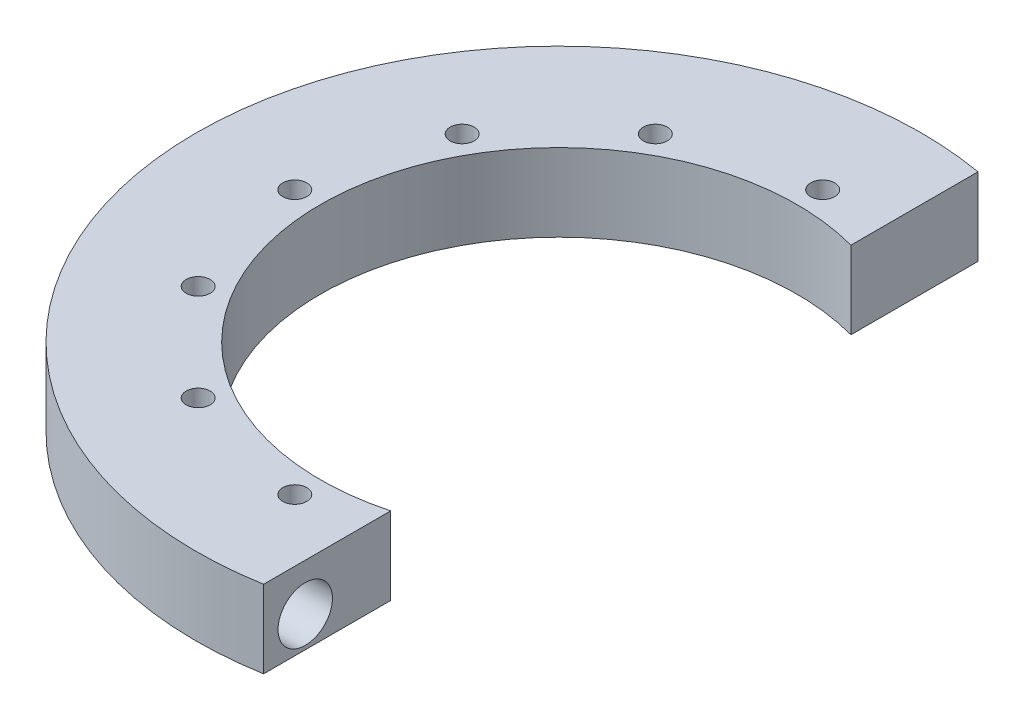
ISO-10303-21;
HEADER;
FILE_DESCRIPTION(('STEP AP214'),'2;1');
FILE_NAME('part.step','',(''),(''),'','','');
FILE_SCHEMA(('AUTOMOTIVE_DESIGN { 1 0 10303 214 1 1 1 1 }'));
ENDSEC;
DATA;
#1=APPLICATION_CONTEXT('core data for automotive mechanical design processes');
#2=APPLICATION_PROTOCOL_DEFINITION('international standard','automotive_design',2000,#1);
#3=PRODUCT_CONTEXT('',#1,'mechanical');
#4=PRODUCT('Part','Part','',(#3));
#5=PRODUCT_RELATED_PRODUCT_CATEGORY('part','',(#4));
#6=PRODUCT_DEFINITION_FORMATION('','',#4);
#7=PRODUCT_DEFINITION_CONTEXT('part definition',#1,'design');
#8=PRODUCT_DEFINITION('design','',#6,#7);
#9=PRODUCT_DEFINITION_SHAPE('','',#8);
#10=(LENGTH_UNIT() NAMED_UNIT(*) SI_UNIT(.MILLI.,.METRE.));
#11=(NAMED_UNIT(*) PLANE_ANGLE_UNIT() SI_UNIT($,.RADIAN.));
#12=(NAMED_UNIT(*) SI_UNIT($,.STERADIAN.) SOLID_ANGLE_UNIT());
#13=UNCERTAINTY_MEASURE_WITH_UNIT(LENGTH_MEASURE(1.E-05),#10,'distance_accuracy_value','');
#14=(GEOMETRIC_REPRESENTATION_CONTEXT(3) GLOBAL_UNCERTAINTY_ASSIGNED_CONTEXT((#13)) GLOBAL_UNIT_ASSIGNED_CONTEXT((#10,
#11,#12)) REPRESENTATION_CONTEXT('',''));
#15=CARTESIAN_POINT('',(0.,0.,0.));
#16=DIRECTION('',(0.,0.,1.));
#17=DIRECTION('',(1.,0.,0.));
#18=AXIS2_PLACEMENT_3D('',#15,#16,#17);
#19=CARTESIAN_POINT('',(0.,-12.7,0.));
#20=DIRECTION('',(1.,0.,0.));
#21=DIRECTION('',(0.,0.,-1.));
#22=AXIS2_PLACEMENT_3D('',#19,#20,#21);
#23=PLANE('',#22);
#24=DIRECTION('',(0.,1.,0.));
#25=VECTOR('',#24,1.);
#26=CARTESIAN_POINT('',(0.,-12.7,61.3579689022021));
#27=LINE('',#26,#25);
#28=CARTESIAN_POINT('',(0.,-1.78519592415086,61.3579689022021));
#29=VERTEX_POINT('',#28);
#30=CARTESIAN_POINT('',(0.,0.,61.3579689022021));
#31=VERTEX_POINT('',#30);
#32=EDGE_CURVE('E155',#29,#31,#27,.T.);
#33=ORIENTED_EDGE('',*,*,#32,.F.);
#34=CARTESIAN_POINT('',(0.,-6.35,64.536818145106));
#35=DIRECTION('',(1.,0.,0.));
#36=DIRECTION('',(0.,0.,-1.));
#37=AXIS2_PLACEMENT_3D('',#34,#35,#36);
#38=CIRCLE('',#37,5.56259999999999);
#39=CARTESIAN_POINT('',(0.,-1.78519592415087,67.71566738801));
#40=VERTEX_POINT('',#39);
#41=EDGE_CURVE('E144',#29,#40,#38,.T.);
#42=ORIENTED_EDGE('',*,*,#41,.T.);
#43=DIRECTION('',(0.,1.,0.));
#44=VECTOR('',#43,1.);
#45=CARTESIAN_POINT('',(0.,-12.7,67.71566738801));
#46=LINE('',#45,#44);
#47=CARTESIAN_POINT('',(0.,0.,67.71566738801));
#48=VERTEX_POINT('',#47);
#49=EDGE_CURVE('E153',#40,#48,#46,.T.);
#50=ORIENTED_EDGE('',*,*,#49,.T.);
#51=DIRECTION('',(0.,0.,-1.));
#52=VECTOR('',#51,1.);
#53=CARTESIAN_POINT('',(0.,0.,0.));
#54=LINE('',#53,#52);
#55=EDGE_CURVE('E230',#48,#31,#54,.T.);
#56=ORIENTED_EDGE('',*,*,#55,.T.);
#57=EDGE_LOOP('',(#33,#42,#50,#56));
#58=FACE_BOUND('',#57,.T.);
#59=ADVANCED_FACE('F39',(#58),#23,.F.);
#60=CARTESIAN_POINT('',(12.7,3.175,0.));
#61=DIRECTION('',(1.,0.,0.));
#62=DIRECTION('',(0.,0.,-1.));
#63=AXIS2_PLACEMENT_3D('',#60,#61,#62);
#64=PLANE('',#63);
#65=CARTESIAN_POINT('',(12.7,-6.35,64.536818145106));
#66=DIRECTION('',(1.,0.,0.));
#67=DIRECTION('',(0.,0.,-1.));
#68=AXIS2_PLACEMENT_3D('',#65,#66,#67);
#69=CIRCLE('',#68,5.56259999999999);
#70=CARTESIAN_POINT('',(12.7,-6.35,58.9742181451061));
#71=VERTEX_POINT('',#70);
#72=EDGE_CURVE('E326',#71,#71,#69,.T.);
#73=ORIENTED_EDGE('',*,*,#72,.F.);
#74=EDGE_LOOP('',(#73));
#75=FACE_BOUND('',#74,.T.);
#76=DIRECTION('',(0.,-1.,0.));
#77=VECTOR('',#76,1.);
#78=CARTESIAN_POINT('',(12.7,3.175,73.0442228845211));
#79=LINE('',#78,#77);
#80=CARTESIAN_POINT('',(12.7,3.175,73.0442228845211));
#81=VERTEX_POINT('',#80);
#82=CARTESIAN_POINT('',(12.7,-12.7,73.0442228845211));
#83=VERTEX_POINT('',#82);
#84=EDGE_CURVE('E189',#81,#83,#79,.T.);
#85=ORIENTED_EDGE('',*,*,#84,.T.);
#86=DIRECTION('',(0.,0.,1.));
#87=VECTOR('',#86,1.);
#88=CARTESIAN_POINT('',(12.7,-12.7,0.));
#89=LINE('',#88,#87);
#90=CARTESIAN_POINT('',(12.7,-12.7,47.0563858451071));
#91=VERTEX_POINT('',#90);
#92=EDGE_CURVE('E205',#91,#83,#89,.T.);
#93=ORIENTED_EDGE('',*,*,#92,.F.);
#94=DIRECTION('',(0.,-1.,0.));
#95=VECTOR('',#94,1.);
#96=CARTESIAN_POINT('',(12.7,3.175,47.0563858451071));
#97=LINE('',#96,#95);
#98=CARTESIAN_POINT('',(12.7,3.175,47.0563858451071));
#99=VERTEX_POINT('',#98);
#100=EDGE_CURVE('E53',#99,#91,#97,.T.);
#101=ORIENTED_EDGE('',*,*,#100,.F.);
#102=DIRECTION('',(0.,0.,1.));
#103=VECTOR('',#102,1.);
#104=CARTESIAN_POINT('',(12.7,3.175,0.));
#105=LINE('',#104,#103);
#106=EDGE_CURVE('E178',#99,#81,#105,.T.);
#107=ORIENTED_EDGE('',*,*,#106,.T.);
#108=EDGE_LOOP('',(#85,#93,#101,#107));
#109=FACE_BOUND('',#108,.T.);
#110=ADVANCED_FACE('F41',(#75,#109),#64,.T.);
#111=CARTESIAN_POINT('',(0.,3.175,0.));
#112=DIRECTION('',(0.,-1.,0.));
#113=DIRECTION('',(0.,0.,-1.));
#114=AXIS2_PLACEMENT_3D('',#111,#112,#113);
#115=CYLINDRICAL_SURFACE('',#114,48.74006);
#116=ORIENTED_EDGE('',*,*,#100,.T.);
#117=CARTESIAN_POINT('',(0.,-12.7,0.));
#118=DIRECTION('',(0.,1.,0.));
#119=DIRECTION('',(0.,0.,1.));
#120=AXIS2_PLACEMENT_3D('',#117,#118,#119);
#121=CIRCLE('',#120,48.74006);
#122=CARTESIAN_POINT('',(12.7,-12.7,-47.0563858451071));
#123=VERTEX_POINT('',#122);
#124=EDGE_CURVE('E201',#91,#123,#121,.F.);
#125=ORIENTED_EDGE('',*,*,#124,.T.);
#126=DIRECTION('',(0.,-1.,0.));
#127=VECTOR('',#126,1.);
#128=CARTESIAN_POINT('',(12.7,3.175,-47.0563858451071));
#129=LINE('',#128,#127);
#130=CARTESIAN_POINT('',(12.7,3.175,-47.0563858451071));
#131=VERTEX_POINT('',#130);
#132=EDGE_CURVE('E193',#131,#123,#129,.T.);
#133=ORIENTED_EDGE('',*,*,#132,.F.);
#134=CARTESIAN_POINT('',(0.,3.175,0.));
#135=DIRECTION('',(0.,1.,0.));
#136=DIRECTION('',(0.,0.,1.));
#137=AXIS2_PLACEMENT_3D('',#134,#135,#136);
#138=CIRCLE('',#137,48.74006);
#139=EDGE_CURVE('E181',#99,#131,#138,.F.);
#140=ORIENTED_EDGE('',*,*,#139,.F.);
#141=EDGE_LOOP('',(#116,#125,#133,#140));
#142=FACE_BOUND('',#141,.T.);
#143=ADVANCED_FACE('F198',(#142),#115,.F.);
#144=CARTESIAN_POINT('',(12.7,3.175,0.));
#145=DIRECTION('',(1.,0.,0.));
#146=DIRECTION('',(0.,0.,-1.));
#147=AXIS2_PLACEMENT_3D('',#144,#145,#146);
#148=PLANE('',#147);
#149=ORIENTED_EDGE('',*,*,#132,.T.);
#150=DIRECTION('',(0.,0.,1.));
#151=VECTOR('',#150,1.);
#152=CARTESIAN_POINT('',(12.7,-12.7,0.));
#153=LINE('',#152,#151);
#154=CARTESIAN_POINT('',(12.7,-12.7,-73.0442228845211));
#155=VERTEX_POINT('',#154);
#156=EDGE_CURVE('E215',#155,#123,#153,.T.);
#157=ORIENTED_EDGE('',*,*,#156,.F.);
#158=DIRECTION('',(0.,-1.,0.));
#159=VECTOR('',#158,1.);
#160=CARTESIAN_POINT('',(12.7,3.175,-73.0442228845211));
#161=LINE('',#160,#159);
#162=CARTESIAN_POINT('',(12.7,3.175,-73.0442228845211));
#163=VERTEX_POINT('',#162);
#164=EDGE_CURVE('E191',#163,#155,#161,.T.);
#165=ORIENTED_EDGE('',*,*,#164,.F.);
#166=DIRECTION('',(0.,0.,1.));
#167=VECTOR('',#166,1.);
#168=CARTESIAN_POINT('',(12.7,3.175,0.));
#169=LINE('',#168,#167);
#170=EDGE_CURVE('E184',#163,#131,#169,.T.);
#171=ORIENTED_EDGE('',*,*,#170,.T.);
#172=EDGE_LOOP('',(#149,#157,#165,#171));
#173=FACE_BOUND('',#172,.T.);
#174=ADVANCED_FACE('F323',(#173),#148,.T.);
#175=CARTESIAN_POINT('',(0.,3.175,0.));
#176=DIRECTION('',(0.,-1.,0.));
#177=DIRECTION('',(0.,0.,-1.));
#178=AXIS2_PLACEMENT_3D('',#175,#176,#177);
#179=CYLINDRICAL_SURFACE('',#178,74.14006);
#180=ORIENTED_EDGE('',*,*,#164,.T.);
#181=CARTESIAN_POINT('',(0.,-12.7,0.));
#182=DIRECTION('',(0.,1.,0.));
#183=DIRECTION('',(0.,0.,1.));
#184=AXIS2_PLACEMENT_3D('',#181,#182,#183);
#185=CIRCLE('',#184,74.14006);
#186=EDGE_CURVE('E177',#155,#83,#185,.T.);
#187=ORIENTED_EDGE('',*,*,#186,.T.);
#188=ORIENTED_EDGE('',*,*,#84,.F.);
#189=CARTESIAN_POINT('',(0.,3.175,0.));
#190=DIRECTION('',(0.,1.,0.));
#191=DIRECTION('',(0.,0.,1.));
#192=AXIS2_PLACEMENT_3D('',#189,#190,#191);
#193=CIRCLE('',#192,74.14006);
#194=EDGE_CURVE('E187',#163,#81,#193,.T.);
#195=ORIENTED_EDGE('',*,*,#194,.F.);
#196=EDGE_LOOP('',(#180,#187,#188,#195));
#197=FACE_BOUND('',#196,.T.);
#198=ADVANCED_FACE('F376',(#197),#179,.T.);
#199=CARTESIAN_POINT('',(0.,3.175,0.));
#200=DIRECTION('',(0.,1.,0.));
#201=DIRECTION('',(0.,0.,1.));
#202=AXIS2_PLACEMENT_3D('',#199,#200,#201);
#203=PLANE('',#202);
#204=CARTESIAN_POINT('',(0.,3.175,53.975));
#205=DIRECTION('',(0.,1.,0.));
#206=DIRECTION('',(0.,0.,1.));
#207=AXIS2_PLACEMENT_3D('',#204,#205,#206);
#208=CIRCLE('',#207,2.45745);
#209=CARTESIAN_POINT('',(0.,3.175,56.43245));
#210=VERTEX_POINT('',#209);
#211=EDGE_CURVE('E367',#210,#210,#208,.T.);
#212=ORIENTED_EDGE('',*,*,#211,.F.);
#213=EDGE_LOOP('',(#212));
#214=FACE_BOUND('',#213,.T.);
#215=CARTESIAN_POINT('',(-26.9874999999997,3.175,46.7437211692652));
#216=DIRECTION('',(0.,1.,0.));
#217=DIRECTION('',(0.,0.,1.));
#218=AXIS2_PLACEMENT_3D('',#215,#216,#217);
#219=CIRCLE('',#218,2.45745);
#220=CARTESIAN_POINT('',(-26.9874999999997,3.175,49.2011711692652));
#221=VERTEX_POINT('',#220);
#222=EDGE_CURVE('E361',#221,#221,#219,.T.);
#223=ORIENTED_EDGE('',*,*,#222,.F.);
#224=EDGE_LOOP('',(#223));
#225=FACE_BOUND('',#224,.T.);
#226=CARTESIAN_POINT('',(-46.743721169265,3.175,26.9875000000002));
#227=DIRECTION('',(0.,1.,0.));
#228=DIRECTION('',(0.,0.,1.));
#229=AXIS2_PLACEMENT_3D('',#226,#227,#228);
#230=CIRCLE('',#229,2.45745);
#231=CARTESIAN_POINT('',(-46.743721169265,3.175,29.4449500000002));
#232=VERTEX_POINT('',#231);
#233=EDGE_CURVE('E355',#232,#232,#230,.T.);
#234=ORIENTED_EDGE('',*,*,#233,.F.);
#235=EDGE_LOOP('',(#234));
#236=FACE_BOUND('',#235,.T.);
#237=CARTESIAN_POINT('',(-53.975,3.175,1.87570085540724E-13));
#238=DIRECTION('',(0.,1.,0.));
#239=DIRECTION('',(0.,0.,1.));
#240=AXIS2_PLACEMENT_3D('',#237,#238,#239);
#241=CIRCLE('',#240,2.45745);
#242=CARTESIAN_POINT('',(-53.975,3.175,2.45745000000019));
#243=VERTEX_POINT('',#242);
#244=EDGE_CURVE('E349',#243,#243,#241,.T.);
#245=ORIENTED_EDGE('',*,*,#244,.F.);
#246=EDGE_LOOP('',(#245));
#247=FACE_BOUND('',#246,.T.);
#248=CARTESIAN_POINT('',(-46.7437211692651,3.175,-26.9874999999999));
#249=DIRECTION('',(0.,1.,0.));
#250=DIRECTION('',(0.,0.,1.));
#251=AXIS2_PLACEMENT_3D('',#248,#249,#250);
#252=CIRCLE('',#251,2.45745);
#253=CARTESIAN_POINT('',(-46.7437211692651,3.175,-24.5300499999999));
#254=VERTEX_POINT('',#253);
#255=EDGE_CURVE('E343',#254,#254,#252,.T.);
#256=ORIENTED_EDGE('',*,*,#255,.F.);
#257=EDGE_LOOP('',(#256));
#258=FACE_BOUND('',#257,.T.);
#259=CARTESIAN_POINT('',(-26.9875000000001,3.175,-46.743721169265));
#260=DIRECTION('',(0.,1.,0.));
#261=DIRECTION('',(0.,0.,1.));
#262=AXIS2_PLACEMENT_3D('',#259,#260,#261);
#263=CIRCLE('',#262,2.45745);
#264=CARTESIAN_POINT('',(-26.9875000000001,3.175,-44.286271169265));
#265=VERTEX_POINT('',#264);
#266=EDGE_CURVE('E337',#265,#265,#263,.T.);
#267=ORIENTED_EDGE('',*,*,#266,.F.);
#268=EDGE_LOOP('',(#267));
#269=FACE_BOUND('',#268,.T.);
#270=CARTESIAN_POINT('',(0.,3.175,-53.975));
#271=DIRECTION('',(0.,1.,0.));
#272=DIRECTION('',(0.,0.,1.));
#273=AXIS2_PLACEMENT_3D('',#270,#271,#272);
#274=CIRCLE('',#273,2.45745);
#275=CARTESIAN_POINT('',(0.,3.175,-51.51755));
#276=VERTEX_POINT('',#275);
#277=EDGE_CURVE('E329',#276,#276,#274,.T.);
#278=ORIENTED_EDGE('',*,*,#277,.F.);
#279=EDGE_LOOP('',(#278));
#280=FACE_BOUND('',#279,.T.);
#281=ORIENTED_EDGE('',*,*,#106,.F.);
#282=ORIENTED_EDGE('',*,*,#139,.T.);
#283=ORIENTED_EDGE('',*,*,#170,.F.);
#284=ORIENTED_EDGE('',*,*,#194,.T.);
#285=EDGE_LOOP('',(#281,#282,#283,#284));
#286=FACE_BOUND('',#285,.T.);
#287=ADVANCED_FACE('F373',(#214,#225,#236,#247,#258,#269,#280,#286),#203,.T.);
#288=CARTESIAN_POINT('',(-3.175,-12.7,-61.3579689022021));
#289=DIRECTION('',(0.,1.,0.));
#290=DIRECTION('',(0.,0.,1.));
#291=AXIS2_PLACEMENT_3D('',#288,#289,#290);
#292=CYLINDRICAL_SURFACE('',#291,3.175);
#293=CARTESIAN_POINT('',(-3.175,0.,-61.3579689022021));
#294=DIRECTION('',(0.,1.,0.));
#295=DIRECTION('',(0.,0.,1.));
#296=AXIS2_PLACEMENT_3D('',#293,#294,#295);
#297=CIRCLE('',#296,3.175);
#298=CARTESIAN_POINT('',(-3.01092748770102,0.,-58.1872110731164));
#299=VERTEX_POINT('',#298);
#300=CARTESIAN_POINT('',(0.,0.,-61.3579689022021));
#301=VERTEX_POINT('',#300);
#302=EDGE_CURVE('E221',#299,#301,#297,.T.);
#303=ORIENTED_EDGE('',*,*,#302,.T.);
#304=DIRECTION('',(0.,1.,0.));
#305=VECTOR('',#304,1.);
#306=CARTESIAN_POINT('',(0.,-12.7,-61.3579689022021));
#307=LINE('',#306,#305);
#308=CARTESIAN_POINT('',(0.,-12.7,-61.3579689022021));
#309=VERTEX_POINT('',#308);
#310=EDGE_CURVE('E182',#309,#301,#307,.T.);
#311=ORIENTED_EDGE('',*,*,#310,.F.);
#312=CARTESIAN_POINT('',(-3.175,-12.7,-61.3579689022021));
#313=DIRECTION('',(0.,1.,0.));
#314=DIRECTION('',(0.,0.,1.));
#315=AXIS2_PLACEMENT_3D('',#312,#313,#314);
#316=CIRCLE('',#315,3.175);
#317=CARTESIAN_POINT('',(-3.01092748770102,-12.7,-58.1872110731164));
#318=VERTEX_POINT('',#317);
#319=EDGE_CURVE('E240',#318,#309,#316,.T.);
#320=ORIENTED_EDGE('',*,*,#319,.F.);
#321=DIRECTION('',(0.,1.,0.));
#322=VECTOR('',#321,1.);
#323=CARTESIAN_POINT('',(-3.01092748770102,-12.7,-58.1872110731164));
#324=LINE('',#323,#322);
#325=EDGE_CURVE('E174',#318,#299,#324,.T.);
#326=ORIENTED_EDGE('',*,*,#325,.T.);
#327=EDGE_LOOP('',(#303,#311,#320,#326));
#328=FACE_BOUND('',#327,.T.);
#329=ADVANCED_FACE('F266',(#328),#292,.F.);
#330=CARTESIAN_POINT('',(0.,-12.7,0.));
#331=DIRECTION('',(1.,0.,0.));
#332=DIRECTION('',(0.,0.,-1.));
#333=AXIS2_PLACEMENT_3D('',#330,#331,#332);
#334=PLANE('',#333);
#335=DIRECTION('',(0.,0.,-1.));
#336=VECTOR('',#335,1.);
#337=CARTESIAN_POINT('',(0.,0.,0.));
#338=LINE('',#337,#336);
#339=CARTESIAN_POINT('',(0.,0.,-67.71566738801));
#340=VERTEX_POINT('',#339);
#341=EDGE_CURVE('E67',#301,#340,#338,.T.);
#342=ORIENTED_EDGE('',*,*,#341,.T.);
#343=DIRECTION('',(0.,1.,0.));
#344=VECTOR('',#343,1.);
#345=CARTESIAN_POINT('',(0.,-12.7,-67.71566738801));
#346=LINE('',#345,#344);
#347=CARTESIAN_POINT('',(0.,-12.7,-67.71566738801));
#348=VERTEX_POINT('',#347);
#349=EDGE_CURVE('E242',#348,#340,#346,.T.);
#350=ORIENTED_EDGE('',*,*,#349,.F.);
#351=DIRECTION('',(0.,0.,-1.));
#352=VECTOR('',#351,1.);
#353=CARTESIAN_POINT('',(0.,-12.7,0.));
#354=LINE('',#353,#352);
#355=EDGE_CURVE('E210',#309,#348,#354,.T.);
#356=ORIENTED_EDGE('',*,*,#355,.F.);
#357=ORIENTED_EDGE('',*,*,#310,.T.);
#358=EDGE_LOOP('',(#342,#350,#356,#357));
#359=FACE_BOUND('',#358,.T.);
#360=ADVANCED_FACE('F261',(#359),#334,.F.);
#361=CARTESIAN_POINT('',(-3.175,-12.7,-67.71566738801));
#362=DIRECTION('',(0.,1.,0.));
#363=DIRECTION('',(0.,0.,1.));
#364=AXIS2_PLACEMENT_3D('',#361,#362,#363);
#365=CYLINDRICAL_SURFACE('',#364,3.175);
#366=CARTESIAN_POINT('',(-3.175,0.,-67.71566738801));
#367=DIRECTION('',(0.,1.,0.));
#368=DIRECTION('',(0.,0.,1.));
#369=AXIS2_PLACEMENT_3D('',#366,#367,#368);
#370=CIRCLE('',#369,3.175);
#371=CARTESIAN_POINT('',(-3.32370358574694,0.,-70.8871831523703));
#372=VERTEX_POINT('',#371);
#373=EDGE_CURVE('E236',#340,#372,#370,.T.);
#374=ORIENTED_EDGE('',*,*,#373,.T.);
#375=DIRECTION('',(0.,1.,0.));
#376=VECTOR('',#375,1.);
#377=CARTESIAN_POINT('',(-3.32370358574694,-12.7,-70.8871831523703));
#378=LINE('',#377,#376);
#379=CARTESIAN_POINT('',(-3.32370358574694,-12.7,-70.8871831523703));
#380=VERTEX_POINT('',#379);
#381=EDGE_CURVE('E244',#380,#372,#378,.T.);
#382=ORIENTED_EDGE('',*,*,#381,.F.);
#383=CARTESIAN_POINT('',(-3.175,-12.7,-67.71566738801));
#384=DIRECTION('',(0.,1.,0.));
#385=DIRECTION('',(0.,0.,1.));
#386=AXIS2_PLACEMENT_3D('',#383,#384,#385);
#387=CIRCLE('',#386,3.175);
#388=EDGE_CURVE('E259',#348,#380,#387,.T.);
#389=ORIENTED_EDGE('',*,*,#388,.F.);
#390=ORIENTED_EDGE('',*,*,#349,.T.);
#391=EDGE_LOOP('',(#374,#382,#389,#390));
#392=FACE_BOUND('',#391,.T.);
#393=ADVANCED_FACE('F256',(#392),#365,.F.);
#394=CARTESIAN_POINT('',(0.,-12.7,0.));
#395=DIRECTION('',(0.,1.,0.));
#396=DIRECTION('',(0.,0.,1.));
#397=AXIS2_PLACEMENT_3D('',#394,#395,#396);
#398=CYLINDRICAL_SURFACE('',#397,70.96506);
#399=CARTESIAN_POINT('',(0.,0.,0.));
#400=DIRECTION('',(0.,1.,0.));
#401=DIRECTION('',(0.,0.,1.));
#402=AXIS2_PLACEMENT_3D('',#399,#400,#401);
#403=CIRCLE('',#402,70.96506);
#404=CARTESIAN_POINT('',(-3.32370358574698,0.,70.8871831523703));
#405=VERTEX_POINT('',#404);
#406=EDGE_CURVE('E233',#372,#405,#403,.T.);
#407=ORIENTED_EDGE('',*,*,#406,.T.);
#408=DIRECTION('',(0.,1.,0.));
#409=VECTOR('',#408,1.);
#410=CARTESIAN_POINT('',(-3.32370358574698,-12.7,70.8871831523703));
#411=LINE('',#410,#409);
#412=CARTESIAN_POINT('',(-3.32370358574698,-12.7,70.8871831523703));
#413=VERTEX_POINT('',#412);
#414=EDGE_CURVE('E165',#413,#405,#411,.T.);
#415=ORIENTED_EDGE('',*,*,#414,.F.);
#416=CARTESIAN_POINT('',(0.,-12.7,0.));
#417=DIRECTION('',(0.,1.,0.));
#418=DIRECTION('',(0.,0.,1.));
#419=AXIS2_PLACEMENT_3D('',#416,#417,#418);
#420=CIRCLE('',#419,70.96506);
#421=EDGE_CURVE('E253',#380,#413,#420,.T.);
#422=ORIENTED_EDGE('',*,*,#421,.F.);
#423=ORIENTED_EDGE('',*,*,#381,.T.);
#424=EDGE_LOOP('',(#407,#415,#422,#423));
#425=FACE_BOUND('',#424,.T.);
#426=ADVANCED_FACE('F252',(#425),#398,.F.);
#427=CARTESIAN_POINT('',(-3.175,-12.7,67.71566738801));
#428=DIRECTION('',(0.,1.,0.));
#429=DIRECTION('',(0.,0.,1.));
#430=AXIS2_PLACEMENT_3D('',#427,#428,#429);
#431=CYLINDRICAL_SURFACE('',#430,3.175);
#432=ORIENTED_EDGE('',*,*,#49,.F.);
#433=CARTESIAN_POINT('',(0.,-1.78519592415087,67.71566738801));
#434=CARTESIAN_POINT('',(-3.83484881048936E-06,-1.86335236917707,67.8279620917721));
#435=CARTESIAN_POINT('',(-0.0059525894724672,-1.9456136557457,67.9371972406602));
#436=CARTESIAN_POINT('',(-0.027852747270737,-2.11719164730099,68.1484960565219));
#437=CARTESIAN_POINT('',(-0.0437793784957013,-2.20649040188001,68.2505767898692));
#438=CARTESIAN_POINT('',(-0.0835601503047486,-2.39043062252106,68.4460633177323));
#439=CARTESIAN_POINT('',(-0.107330758074413,-2.48500741977627,68.5395477854168));
#440=CARTESIAN_POINT('',(-0.161165859120224,-2.67965654168267,68.7187562334342));
#441=CARTESIAN_POINT('',(-0.19123480474233,-2.77973271677387,68.8044746621551));
#442=CARTESIAN_POINT('',(-0.262977234814786,-3.0066073599484,68.9853629527845));
#443=CARTESIAN_POINT('',(-0.305758051230419,-3.13455420465276,69.0786517135478));
#444=CARTESIAN_POINT('',(-0.39550642025967,-3.39686331863911,69.2534220944847));
#445=CARTESIAN_POINT('',(-0.442474624831278,-3.53122658541236,69.3349018708478));
#446=CARTESIAN_POINT('',(-0.538100062013969,-3.80655436468362,69.4863845179815));
#447=CARTESIAN_POINT('',(-0.586763993465385,-3.94754607203731,69.5563336163358));
#448=CARTESIAN_POINT('',(-0.682633044183698,-4.23533834539223,69.6841970796539));
#449=CARTESIAN_POINT('',(-0.729838579429793,-4.38213722725135,69.7421149037935));
#450=CARTESIAN_POINT('',(-0.807830295045266,-4.64260437687625,69.832199554512));
#451=CARTESIAN_POINT('',(-0.839699400097374,-4.75498954744713,69.8671490621021));
#452=CARTESIAN_POINT('',(-0.899289334304043,-4.98282722843186,69.930084832773));
#453=CARTESIAN_POINT('',(-0.927009222279351,-5.09828042780344,69.9580695169533));
#454=CARTESIAN_POINT('',(-0.976539011258575,-5.33138768263972,70.0066488381157));
#455=CARTESIAN_POINT('',(-0.998377226606285,-5.44902816948765,70.027279040872));
#456=CARTESIAN_POINT('',(-1.03475236588271,-5.68645268806202,70.0609999991819));
#457=CARTESIAN_POINT('',(-1.04929386688778,-5.80623532709619,70.0740954818658));
#458=CARTESIAN_POINT('',(-1.06999160246547,-6.04859198258079,70.0925908886945));
#459=CARTESIAN_POINT('',(-1.0760452940266,-6.17118224847573,70.0978967401044));
#460=CARTESIAN_POINT('',(-1.07885867610431,-6.41654650537615,70.1003730365298));
#461=CARTESIAN_POINT('',(-1.07561882759102,-6.5393204869672,70.0975438850508));
#462=CARTESIAN_POINT('',(-1.06014045224274,-6.78413757010204,70.0838093254438));
#463=CARTESIAN_POINT('',(-1.04787988117742,-6.90617814152924,70.0728841322867));
#464=CARTESIAN_POINT('',(-1.01544350254071,-7.14820618408917,70.0432028890463));
#465=CARTESIAN_POINT('',(-0.99526571343944,-7.26819313338718,70.0244448784815));
#466=CARTESIAN_POINT('',(-0.91512241142168,-7.67528691908457,69.9472038920537));
#467=CARTESIAN_POINT('',(-0.839521541005604,-7.95601853164738,69.8702721038457));
#468=CARTESIAN_POINT('',(-0.715529427893798,-8.36258834494578,69.7245853066846));
#469=CARTESIAN_POINT('',(-0.672324265659057,-8.49597420389088,69.6708193702968));
#470=CARTESIAN_POINT('',(-0.584793099698454,-8.75794929599934,69.5532777867557));
#471=CARTESIAN_POINT('',(-0.540467248802298,-8.88653917733923,69.4895034983431));
#472=CARTESIAN_POINT('',(-0.450908133570405,-9.14457337819623,69.348832491588));
#473=CARTESIAN_POINT('',(-0.40572895121806,-9.27377788997962,69.2714625102664));
#474=CARTESIAN_POINT('',(-0.31898912031708,-9.52638124484021,69.1058361537287));
#475=CARTESIAN_POINT('',(-0.277429434537977,-9.64977853923653,69.0175768970109));
#476=CARTESIAN_POINT('',(-0.200557706091549,-9.88940747652771,68.8307736631276));
#477=CARTESIAN_POINT('',(-0.165210718296787,-10.005676635373,68.7322925160456));
#478=CARTESIAN_POINT('',(-0.102956466000138,-10.2308507105333,68.5249145498775));
#479=CARTESIAN_POINT('',(-0.076041586586066,-10.3397622013104,68.4160272451118));
#480=CARTESIAN_POINT('',(-0.0374310628146039,-10.5286659322805,68.2106072807585));
#481=CARTESIAN_POINT('',(-0.0237890696152099,-10.6101501867163,68.1158189414654));
#482=CARTESIAN_POINT('',(-0.00505958378728947,-10.7672009255754,67.9201196594571));
#483=CARTESIAN_POINT('',(-2.84355926687058E-06,-10.8427452157759,67.81918804259));
#484=CARTESIAN_POINT('',(0.,-10.9148040758491,67.71566738801));
#485=B_SPLINE_CURVE_WITH_KNOTS('',3,(#433,#434,#435,#436,#437,#438,#439,#440,#441,#442,#443,
#444,#445,#446,#447,#448,#449,#450,#451,#452,#453,#454,#455,#456,#457,#458,#459,#460,#461,#462,
#463,#464,#465,#466,#467,#468,#469,#470,#471,#472,#473,#474,#475,#476,#477,#478,#479,#480,#481,
#482,#483,#484),.UNSPECIFIED.,.F.,.F.,(4,2,2,2,2,2,2,2,2,2,2,2,2,2,2,2,2,2,2,2,2,2,2,2,2,4),(0.,
0.409985475299674,0.818957096617658,1.22370690762688,1.62874381104658,2.12013279866308,
2.61159842744986,3.10529482085948,3.59884907191835,3.96438312206477,4.32999996214394,
4.69382392039467,5.0574193732916,5.42537072126165,5.79330381874265,6.16213904517287,
6.53106664302548,7.42755096028845,7.87782561437017,8.32803919165992,8.7992482446114,
9.27058225662421,9.73917379396392,10.2073409251696,10.5840130952495,10.9620316814721),.UNSPECIFIED.);
#486=CARTESIAN_POINT('',(0.,-10.9148040758491,67.71566738801));
#487=VERTEX_POINT('',#486);
#488=EDGE_CURVE('E11',#40,#487,#485,.T.);
#489=ORIENTED_EDGE('',*,*,#488,.T.);
#490=CARTESIAN_POINT('',(0.,-12.7,67.71566738801));
#491=VERTEX_POINT('',#490);
#492=EDGE_CURVE('E162',#491,#487,#46,.T.);
#493=ORIENTED_EDGE('',*,*,#492,.F.);
#494=CARTESIAN_POINT('',(-3.175,-12.7,67.71566738801));
#495=DIRECTION('',(0.,1.,0.));
#496=DIRECTION('',(0.,0.,1.));
#497=AXIS2_PLACEMENT_3D('',#494,#495,#496);
#498=CIRCLE('',#497,3.175);
#499=EDGE_CURVE('E251',#413,#491,#498,.T.);
#500=ORIENTED_EDGE('',*,*,#499,.F.);
#501=ORIENTED_EDGE('',*,*,#414,.T.);
#502=CARTESIAN_POINT('',(-3.175,0.,67.71566738801));
#503=DIRECTION('',(0.,1.,0.));
#504=DIRECTION('',(0.,0.,1.));
#505=AXIS2_PLACEMENT_3D('',#502,#503,#504);
#506=CIRCLE('',#505,3.175);
#507=EDGE_CURVE('E161',#405,#48,#506,.T.);
#508=ORIENTED_EDGE('',*,*,#507,.T.);
#509=EDGE_LOOP('',(#432,#489,#493,#500,#501,#508));
#510=FACE_BOUND('',#509,.T.);
#511=ADVANCED_FACE('F159',(#510),#431,.F.);
#512=ORIENTED_EDGE('',*,*,#492,.T.);
#513=CARTESIAN_POINT('',(0.,-10.9148040758491,61.3579689022021));
#514=VERTEX_POINT('',#513);
#515=EDGE_CURVE('E60',#487,#514,#38,.T.);
#516=ORIENTED_EDGE('',*,*,#515,.T.);
#517=CARTESIAN_POINT('',(0.,-12.7,61.3579689022021));
#518=VERTEX_POINT('',#517);
#519=EDGE_CURVE('E163',#518,#514,#27,.T.);
#520=ORIENTED_EDGE('',*,*,#519,.F.);
#521=DIRECTION('',(0.,0.,-1.));
#522=VECTOR('',#521,1.);
#523=CARTESIAN_POINT('',(0.,-12.7,0.));
#524=LINE('',#523,#522);
#525=EDGE_CURVE('E645',#491,#518,#524,.T.);
#526=ORIENTED_EDGE('',*,*,#525,.F.);
#527=EDGE_LOOP('',(#512,#516,#520,#526));
#528=FACE_BOUND('',#527,.T.);
#529=ADVANCED_FACE('F309',(#528),#23,.F.);
#530=CARTESIAN_POINT('',(-3.175,-12.7,61.3579689022021));
#531=DIRECTION('',(0.,1.,0.));
#532=DIRECTION('',(0.,0.,1.));
#533=AXIS2_PLACEMENT_3D('',#530,#531,#532);
#534=CYLINDRICAL_SURFACE('',#533,3.175);
#535=ORIENTED_EDGE('',*,*,#519,.T.);
#536=CARTESIAN_POINT('',(0.,-10.9148040758491,61.3579689022021));
#537=CARTESIAN_POINT('',(-3.83484881456058E-06,-10.8366476308229,61.24567419844));
#538=CARTESIAN_POINT('',(-0.00595258947247137,-10.7543863442543,61.1364390495519));
#539=CARTESIAN_POINT('',(-0.0278527472707413,-10.582808352699,60.9251402336901));
#540=CARTESIAN_POINT('',(-0.0437793784957061,-10.49350959812,60.8230595003429));
#541=CARTESIAN_POINT('',(-0.0835601503047526,-10.309569377479,60.6275729724798));
#542=CARTESIAN_POINT('',(-0.107330758074415,-10.2149925802237,60.5340885047953));
#543=CARTESIAN_POINT('',(-0.161165859120226,-10.0203434583174,60.3548800567778));
#544=CARTESIAN_POINT('',(-0.191234804742333,-9.92026728322615,60.269161628057));
#545=CARTESIAN_POINT('',(-0.26297723481479,-9.69339264005162,60.0882733374275));
#546=CARTESIAN_POINT('',(-0.305758051230422,-9.56544579534727,59.9949845766643));
#547=CARTESIAN_POINT('',(-0.395506420259674,-9.30313668136092,59.8202141957274));
#548=CARTESIAN_POINT('',(-0.442474624831283,-9.16877341458766,59.7387344193643));
#549=CARTESIAN_POINT('',(-0.538100062013976,-8.89344563531639,59.5872517722306));
#550=CARTESIAN_POINT('',(-0.586763993465391,-8.75245392796271,59.5173026738763));
#551=CARTESIAN_POINT('',(-0.682633044183706,-8.46466165460779,59.3894392105582));
#552=CARTESIAN_POINT('',(-0.729838579429802,-8.31786277274867,59.3315213864185));
#553=CARTESIAN_POINT('',(-0.807830295045277,-8.05739562312377,59.2414367357001));
#554=CARTESIAN_POINT('',(-0.839699400097385,-7.94501045255289,59.20648722811));
#555=CARTESIAN_POINT('',(-0.899289334304054,-7.71717277156817,59.1435514574391));
#556=CARTESIAN_POINT('',(-0.927009222279363,-7.60171957219659,59.1155667732588));
#557=CARTESIAN_POINT('',(-0.976539011258588,-7.3686123173603,59.0669874520964));
#558=CARTESIAN_POINT('',(-0.998377226606298,-7.25097183051238,59.0463572493401));
#559=CARTESIAN_POINT('',(-1.03475236588272,-7.01354731193801,59.0126362910302));
#560=CARTESIAN_POINT('',(-1.0492938668878,-6.89376467290384,58.9995408083462));
#561=CARTESIAN_POINT('',(-1.06999160246549,-6.65140801741924,58.9810454015175));
#562=CARTESIAN_POINT('',(-1.07604529402662,-6.5288177515243,58.9757395501077));
#563=CARTESIAN_POINT('',(-1.07885867610433,-6.28345349462388,58.9732632536823));
#564=CARTESIAN_POINT('',(-1.07561882759104,-6.16067951303282,58.9760924051613));
#565=CARTESIAN_POINT('',(-1.06014045224276,-5.91586242989799,58.9898269647683));
#566=CARTESIAN_POINT('',(-1.04787988117744,-5.79382185847079,59.0007521579254));
#567=CARTESIAN_POINT('',(-1.01544350254073,-5.55179381591085,59.0304334011658));
#568=CARTESIAN_POINT('',(-0.995265713439461,-5.43180686661285,59.0491914117306));
#569=CARTESIAN_POINT('',(-0.915122411421703,-5.02471308091546,59.1264323981584));
#570=CARTESIAN_POINT('',(-0.839521541005628,-4.74398146835265,59.2033641863664));
#571=CARTESIAN_POINT('',(-0.715529427893823,-4.33741165505426,59.3490509835275));
#572=CARTESIAN_POINT('',(-0.672324265659083,-4.20402579610916,59.4028169199153));
#573=CARTESIAN_POINT('',(-0.584793099698478,-3.9420507040007,59.5203585034564));
#574=CARTESIAN_POINT('',(-0.540467248802321,-3.81346082266081,59.584132791869));
#575=CARTESIAN_POINT('',(-0.450908133570427,-3.55542662180381,59.7248037986241));
#576=CARTESIAN_POINT('',(-0.405728951218083,-3.42622211002042,59.8021737799456));
#577=CARTESIAN_POINT('',(-0.318989120317102,-3.17361875515984,59.9678001364833));
#578=CARTESIAN_POINT('',(-0.277429434537998,-3.05022146076351,60.0560593932012));
#579=CARTESIAN_POINT('',(-0.200557706091568,-2.81059252347233,60.2428626270844));
#580=CARTESIAN_POINT('',(-0.165210718296807,-2.69432336462702,60.3413437741665));
#581=CARTESIAN_POINT('',(-0.102956466000155,-2.46914928946676,60.5487217403345));
#582=CARTESIAN_POINT('',(-0.0760415865860801,-2.36023779868965,60.6576090451002));
#583=CARTESIAN_POINT('',(-0.0374310628146138,-2.17133406771953,60.8630290094535));
#584=CARTESIAN_POINT('',(-0.0237890696152185,-2.08984981328371,60.9578173487466));
#585=CARTESIAN_POINT('',(-0.00505958378729573,-1.93279907442462,61.1535166307549));
#586=CARTESIAN_POINT('',(-2.84355927233858E-06,-1.85725478422406,61.2544482476221));
#587=CARTESIAN_POINT('',(0.,-1.78519592415086,61.3579689022021));
#588=B_SPLINE_CURVE_WITH_KNOTS('',3,(#536,#537,#538,#539,#540,#541,#542,#543,#544,#545,#546,
#547,#548,#549,#550,#551,#552,#553,#554,#555,#556,#557,#558,#559,#560,#561,#562,#563,#564,#565,
#566,#567,#568,#569,#570,#571,#572,#573,#574,#575,#576,#577,#578,#579,#580,#581,#582,#583,#584,
#585,#586,#587),.UNSPECIFIED.,.F.,.F.,(4,2,2,2,2,2,2,2,2,2,2,2,2,2,2,2,2,2,2,2,2,2,2,2,2,4),(0.,
0.409985475299667,0.818957096617657,1.22370690762688,1.62874381104658,2.12013279866307,
2.61159842744986,3.10529482085948,3.59884907191835,3.96438312206476,4.32999996214394,
4.69382392039466,5.05741937329159,5.42537072126165,5.79330381874264,6.16213904517287,
6.53106664302547,7.42755096028844,7.87782561437016,8.32803919165991,8.79924824461138,
9.27058225662418,9.73917379396389,10.2073409251696,10.5840130952495,10.9620316814721),.UNSPECIFIED.);
#589=EDGE_CURVE('E156',#514,#29,#588,.T.);
#590=ORIENTED_EDGE('',*,*,#589,.T.);
#591=ORIENTED_EDGE('',*,*,#32,.T.);
#592=CARTESIAN_POINT('',(-3.175,0.,61.3579689022021));
#593=DIRECTION('',(0.,1.,0.));
#594=DIRECTION('',(0.,0.,1.));
#595=AXIS2_PLACEMENT_3D('',#592,#593,#594);
#596=CIRCLE('',#595,3.175);
#597=CARTESIAN_POINT('',(-3.01092748770102,0.,58.1872110731164));
#598=VERTEX_POINT('',#597);
#599=EDGE_CURVE('E227',#31,#598,#596,.T.);
#600=ORIENTED_EDGE('',*,*,#599,.T.);
#601=DIRECTION('',(0.,1.,0.));
#602=VECTOR('',#601,1.);
#603=CARTESIAN_POINT('',(-3.01092748770102,-12.7,58.1872110731164));
#604=LINE('',#603,#602);
#605=CARTESIAN_POINT('',(-3.01092748770102,-12.7,58.1872110731164));
#606=VERTEX_POINT('',#605);
#607=EDGE_CURVE('E171',#606,#598,#604,.T.);
#608=ORIENTED_EDGE('',*,*,#607,.F.);
#609=CARTESIAN_POINT('',(-3.175,-12.7,61.3579689022021));
#610=DIRECTION('',(0.,1.,0.));
#611=DIRECTION('',(0.,0.,1.));
#612=AXIS2_PLACEMENT_3D('',#609,#610,#611);
#613=CIRCLE('',#612,3.175);
#614=EDGE_CURVE('E277',#518,#606,#613,.T.);
#615=ORIENTED_EDGE('',*,*,#614,.F.);
#616=EDGE_LOOP('',(#535,#590,#591,#600,#608,#615));
#617=FACE_BOUND('',#616,.T.);
#618=ADVANCED_FACE('F276',(#617),#534,.F.);
#619=CARTESIAN_POINT('',(0.,-12.7,0.));
#620=DIRECTION('',(0.,1.,0.));
#621=DIRECTION('',(0.,0.,1.));
#622=AXIS2_PLACEMENT_3D('',#619,#620,#621);
#623=CYLINDRICAL_SURFACE('',#622,58.26506);
#624=CARTESIAN_POINT('',(0.,0.,0.));
#625=DIRECTION('',(0.,1.,0.));
#626=DIRECTION('',(0.,0.,1.));
#627=AXIS2_PLACEMENT_3D('',#624,#625,#626);
#628=CIRCLE('',#627,58.26506);
#629=EDGE_CURVE('E224',#598,#299,#628,.F.);
#630=ORIENTED_EDGE('',*,*,#629,.T.);
#631=ORIENTED_EDGE('',*,*,#325,.F.);
#632=CARTESIAN_POINT('',(0.,-12.7,0.));
#633=DIRECTION('',(0.,1.,0.));
#634=DIRECTION('',(0.,0.,1.));
#635=AXIS2_PLACEMENT_3D('',#632,#633,#634);
#636=CIRCLE('',#635,58.26506);
#637=EDGE_CURVE('E273',#606,#318,#636,.F.);
#638=ORIENTED_EDGE('',*,*,#637,.F.);
#639=ORIENTED_EDGE('',*,*,#607,.T.);
#640=EDGE_LOOP('',(#630,#631,#638,#639));
#641=FACE_BOUND('',#640,.T.);
#642=ADVANCED_FACE('F270',(#641),#623,.T.);
#643=CARTESIAN_POINT('',(0.,-12.7,0.));
#644=DIRECTION('',(0.,1.,0.));
#645=DIRECTION('',(0.,0.,1.));
#646=AXIS2_PLACEMENT_3D('',#643,#644,#645);
#647=PLANE('',#646);
#648=CARTESIAN_POINT('',(0.,-12.7,53.975));
#649=DIRECTION('',(0.,1.,0.));
#650=DIRECTION('',(0.,0.,1.));
#651=AXIS2_PLACEMENT_3D('',#648,#649,#650);
#652=CIRCLE('',#651,2.45745);
#653=CARTESIAN_POINT('',(0.,-12.7,56.43245));
#654=VERTEX_POINT('',#653);
#655=EDGE_CURVE('E364',#654,#654,#652,.T.);
#656=ORIENTED_EDGE('',*,*,#655,.T.);
#657=EDGE_LOOP('',(#656));
#658=FACE_BOUND('',#657,.T.);
#659=CARTESIAN_POINT('',(-26.9874999999997,-12.7,46.7437211692652));
#660=DIRECTION('',(0.,1.,0.));
#661=DIRECTION('',(0.,0.,1.));
#662=AXIS2_PLACEMENT_3D('',#659,#660,#661);
#663=CIRCLE('',#662,2.45745);
#664=CARTESIAN_POINT('',(-26.9874999999997,-12.7,49.2011711692652));
#665=VERTEX_POINT('',#664);
#666=EDGE_CURVE('E358',#665,#665,#663,.T.);
#667=ORIENTED_EDGE('',*,*,#666,.T.);
#668=EDGE_LOOP('',(#667));
#669=FACE_BOUND('',#668,.T.);
#670=CARTESIAN_POINT('',(-46.743721169265,-12.7,26.9875000000002));
#671=DIRECTION('',(0.,1.,0.));
#672=DIRECTION('',(0.,0.,1.));
#673=AXIS2_PLACEMENT_3D('',#670,#671,#672);
#674=CIRCLE('',#673,2.45745);
#675=CARTESIAN_POINT('',(-46.743721169265,-12.7,29.4449500000002));
#676=VERTEX_POINT('',#675);
#677=EDGE_CURVE('E352',#676,#676,#674,.T.);
#678=ORIENTED_EDGE('',*,*,#677,.T.);
#679=EDGE_LOOP('',(#678));
#680=FACE_BOUND('',#679,.T.);
#681=CARTESIAN_POINT('',(-53.975,-12.7,1.87570085540724E-13));
#682=DIRECTION('',(0.,1.,0.));
#683=DIRECTION('',(0.,0.,1.));
#684=AXIS2_PLACEMENT_3D('',#681,#682,#683);
#685=CIRCLE('',#684,2.45744999999999);
#686=CARTESIAN_POINT('',(-53.975,-12.7,2.45745000000018));
#687=VERTEX_POINT('',#686);
#688=EDGE_CURVE('E346',#687,#687,#685,.T.);
#689=ORIENTED_EDGE('',*,*,#688,.T.);
#690=EDGE_LOOP('',(#689));
#691=FACE_BOUND('',#690,.T.);
#692=CARTESIAN_POINT('',(-46.7437211692651,-12.7,-26.9874999999999));
#693=DIRECTION('',(0.,1.,0.));
#694=DIRECTION('',(0.,0.,1.));
#695=AXIS2_PLACEMENT_3D('',#692,#693,#694);
#696=CIRCLE('',#695,2.45745);
#697=CARTESIAN_POINT('',(-46.7437211692651,-12.7,-24.5300499999999));
#698=VERTEX_POINT('',#697);
#699=EDGE_CURVE('E340',#698,#698,#696,.T.);
#700=ORIENTED_EDGE('',*,*,#699,.T.);
#701=EDGE_LOOP('',(#700));
#702=FACE_BOUND('',#701,.T.);
#703=CARTESIAN_POINT('',(-26.9875000000001,-12.7,-46.743721169265));
#704=DIRECTION('',(0.,1.,0.));
#705=DIRECTION('',(0.,0.,1.));
#706=AXIS2_PLACEMENT_3D('',#703,#704,#705);
#707=CIRCLE('',#706,2.45745);
#708=CARTESIAN_POINT('',(-26.9875000000001,-12.7,-44.286271169265));
#709=VERTEX_POINT('',#708);
#710=EDGE_CURVE('E334',#709,#709,#707,.T.);
#711=ORIENTED_EDGE('',*,*,#710,.T.);
#712=EDGE_LOOP('',(#711));
#713=FACE_BOUND('',#712,.T.);
#714=CARTESIAN_POINT('',(0.,-12.7,-53.975));
#715=DIRECTION('',(0.,1.,0.));
#716=DIRECTION('',(0.,0.,1.));
#717=AXIS2_PLACEMENT_3D('',#714,#715,#716);
#718=CIRCLE('',#717,2.45745);
#719=CARTESIAN_POINT('',(0.,-12.7,-51.51755));
#720=VERTEX_POINT('',#719);
#721=EDGE_CURVE('E327',#720,#720,#718,.T.);
#722=ORIENTED_EDGE('',*,*,#721,.T.);
#723=EDGE_LOOP('',(#722));
#724=FACE_BOUND('',#723,.T.);
#725=ORIENTED_EDGE('',*,*,#319,.T.);
#726=ORIENTED_EDGE('',*,*,#355,.T.);
#727=ORIENTED_EDGE('',*,*,#388,.T.);
#728=ORIENTED_EDGE('',*,*,#421,.T.);
#729=ORIENTED_EDGE('',*,*,#499,.T.);
#730=ORIENTED_EDGE('',*,*,#525,.T.);
#731=ORIENTED_EDGE('',*,*,#614,.T.);
#732=ORIENTED_EDGE('',*,*,#637,.T.);
#733=EDGE_LOOP('',(#725,#726,#727,#728,#729,#730,#731,#732));
#734=FACE_BOUND('',#733,.T.);
#735=ORIENTED_EDGE('',*,*,#92,.T.);
#736=ORIENTED_EDGE('',*,*,#186,.F.);
#737=ORIENTED_EDGE('',*,*,#156,.T.);
#738=ORIENTED_EDGE('',*,*,#124,.F.);
#739=EDGE_LOOP('',(#735,#736,#737,#738));
#740=FACE_BOUND('',#739,.T.);
#741=ADVANCED_FACE('F213',(#658,#669,#680,#691,#702,#713,#724,#734,#740),#647,.F.);
#742=CARTESIAN_POINT('',(0.,0.,0.));
#743=DIRECTION('',(0.,1.,0.));
#744=DIRECTION('',(0.,0.,1.));
#745=AXIS2_PLACEMENT_3D('',#742,#743,#744);
#746=PLANE('',#745);
#747=ORIENTED_EDGE('',*,*,#302,.F.);
#748=ORIENTED_EDGE('',*,*,#629,.F.);
#749=ORIENTED_EDGE('',*,*,#599,.F.);
#750=ORIENTED_EDGE('',*,*,#55,.F.);
#751=ORIENTED_EDGE('',*,*,#507,.F.);
#752=ORIENTED_EDGE('',*,*,#406,.F.);
#753=ORIENTED_EDGE('',*,*,#373,.F.);
#754=ORIENTED_EDGE('',*,*,#341,.F.);
#755=EDGE_LOOP('',(#747,#748,#749,#750,#751,#752,#753,#754));
#756=FACE_BOUND('',#755,.T.);
#757=ADVANCED_FACE('F254',(#756),#746,.F.);
#758=CARTESIAN_POINT('',(12.7,-6.35,64.536818145106));
#759=DIRECTION('',(1.,0.,0.));
#760=DIRECTION('',(0.,0.,-1.));
#761=AXIS2_PLACEMENT_3D('',#758,#759,#760);
#762=CYLINDRICAL_SURFACE('',#761,5.56259999999999);
#763=ORIENTED_EDGE('',*,*,#72,.T.);
#764=EDGE_LOOP('',(#763));
#765=FACE_BOUND('',#764,.T.);
#766=ORIENTED_EDGE('',*,*,#515,.F.);
#767=ORIENTED_EDGE('',*,*,#488,.F.);
#768=ORIENTED_EDGE('',*,*,#41,.F.);
#769=ORIENTED_EDGE('',*,*,#589,.F.);
#770=EDGE_LOOP('',(#766,#767,#768,#769));
#771=FACE_BOUND('',#770,.T.);
#772=ADVANCED_FACE('F143',(#765,#771),#762,.F.);
#773=CARTESIAN_POINT('',(0.,3.175,-53.975));
#774=DIRECTION('',(0.,1.,0.));
#775=DIRECTION('',(0.,0.,1.));
#776=AXIS2_PLACEMENT_3D('',#773,#774,#775);
#777=CYLINDRICAL_SURFACE('',#776,2.45745);
#778=ORIENTED_EDGE('',*,*,#721,.F.);
#779=EDGE_LOOP('',(#778));
#780=FACE_BOUND('',#779,.T.);
#781=ORIENTED_EDGE('',*,*,#277,.T.);
#782=EDGE_LOOP('',(#781));
#783=FACE_BOUND('',#782,.T.);
#784=ADVANCED_FACE('F295',(#780,#783),#777,.F.);
#785=CARTESIAN_POINT('',(-26.9875000000001,3.175,-46.743721169265));
#786=DIRECTION('',(0.,1.,0.));
#787=DIRECTION('',(0.,0.,1.));
#788=AXIS2_PLACEMENT_3D('',#785,#786,#787);
#789=CYLINDRICAL_SURFACE('',#788,2.45745);
#790=ORIENTED_EDGE('',*,*,#710,.F.);
#791=EDGE_LOOP('',(#790));
#792=FACE_BOUND('',#791,.T.);
#793=ORIENTED_EDGE('',*,*,#266,.T.);
#794=EDGE_LOOP('',(#793));
#795=FACE_BOUND('',#794,.T.);
#796=ADVANCED_FACE('F430',(#792,#795),#789,.F.);
#797=CARTESIAN_POINT('',(-46.7437211692651,3.175,-26.9874999999999));
#798=DIRECTION('',(0.,1.,0.));
#799=DIRECTION('',(0.,0.,1.));
#800=AXIS2_PLACEMENT_3D('',#797,#798,#799);
#801=CYLINDRICAL_SURFACE('',#800,2.45745);
#802=ORIENTED_EDGE('',*,*,#699,.F.);
#803=EDGE_LOOP('',(#802));
#804=FACE_BOUND('',#803,.T.);
#805=ORIENTED_EDGE('',*,*,#255,.T.);
#806=EDGE_LOOP('',(#805));
#807=FACE_BOUND('',#806,.T.);
#808=ADVANCED_FACE('F436',(#804,#807),#801,.F.);
#809=CARTESIAN_POINT('',(-53.975,3.175,1.87570085540724E-13));
#810=DIRECTION('',(0.,1.,0.));
#811=DIRECTION('',(0.,0.,1.));
#812=AXIS2_PLACEMENT_3D('',#809,#810,#811);
#813=CYLINDRICAL_SURFACE('',#812,2.45745);
#814=ORIENTED_EDGE('',*,*,#688,.F.);
#815=EDGE_LOOP('',(#814));
#816=FACE_BOUND('',#815,.T.);
#817=ORIENTED_EDGE('',*,*,#244,.T.);
#818=EDGE_LOOP('',(#817));
#819=FACE_BOUND('',#818,.T.);
#820=ADVANCED_FACE('F443',(#816,#819),#813,.F.);
#821=CARTESIAN_POINT('',(-46.743721169265,3.175,26.9875000000002));
#822=DIRECTION('',(0.,1.,0.));
#823=DIRECTION('',(0.,0.,1.));
#824=AXIS2_PLACEMENT_3D('',#821,#822,#823);
#825=CYLINDRICAL_SURFACE('',#824,2.45745);
#826=ORIENTED_EDGE('',*,*,#677,.F.);
#827=EDGE_LOOP('',(#826));
#828=FACE_BOUND('',#827,.T.);
#829=ORIENTED_EDGE('',*,*,#233,.T.);
#830=EDGE_LOOP('',(#829));
#831=FACE_BOUND('',#830,.T.);
#832=ADVANCED_FACE('F451',(#828,#831),#825,.F.);
#833=CARTESIAN_POINT('',(-26.9874999999997,3.175,46.7437211692652));
#834=DIRECTION('',(0.,1.,0.));
#835=DIRECTION('',(0.,0.,1.));
#836=AXIS2_PLACEMENT_3D('',#833,#834,#835);
#837=CYLINDRICAL_SURFACE('',#836,2.45745);
#838=ORIENTED_EDGE('',*,*,#666,.F.);
#839=EDGE_LOOP('',(#838));
#840=FACE_BOUND('',#839,.T.);
#841=ORIENTED_EDGE('',*,*,#222,.T.);
#842=EDGE_LOOP('',(#841));
#843=FACE_BOUND('',#842,.T.);
#844=ADVANCED_FACE('F459',(#840,#843),#837,.F.);
#845=CARTESIAN_POINT('',(0.,3.175,53.975));
#846=DIRECTION('',(0.,1.,0.));
#847=DIRECTION('',(0.,0.,1.));
#848=AXIS2_PLACEMENT_3D('',#845,#846,#847);
#849=CYLINDRICAL_SURFACE('',#848,2.45745);
#850=ORIENTED_EDGE('',*,*,#655,.F.);
#851=EDGE_LOOP('',(#850));
#852=FACE_BOUND('',#851,.T.);
#853=ORIENTED_EDGE('',*,*,#211,.T.);
#854=EDGE_LOOP('',(#853));
#855=FACE_BOUND('',#854,.T.);
#856=ADVANCED_FACE('F371',(#852,#855),#849,.F.);
#857=CLOSED_SHELL('',(#59,#110,#143,#174,#198,#287,#329,#360,#393,#426,#511,#529,#618,#642,#741,
#757,#772,#784,#796,#808,#820,#832,#844,#856));
#858=MANIFOLD_SOLID_BREP('B2',#857);
#859=ADVANCED_BREP_SHAPE_REPRESENTATION('',(#18,#858),#14);
#860=SHAPE_DEFINITION_REPRESENTATION(#9,#859);
ENDSEC;
END-ISO-10303-21;
